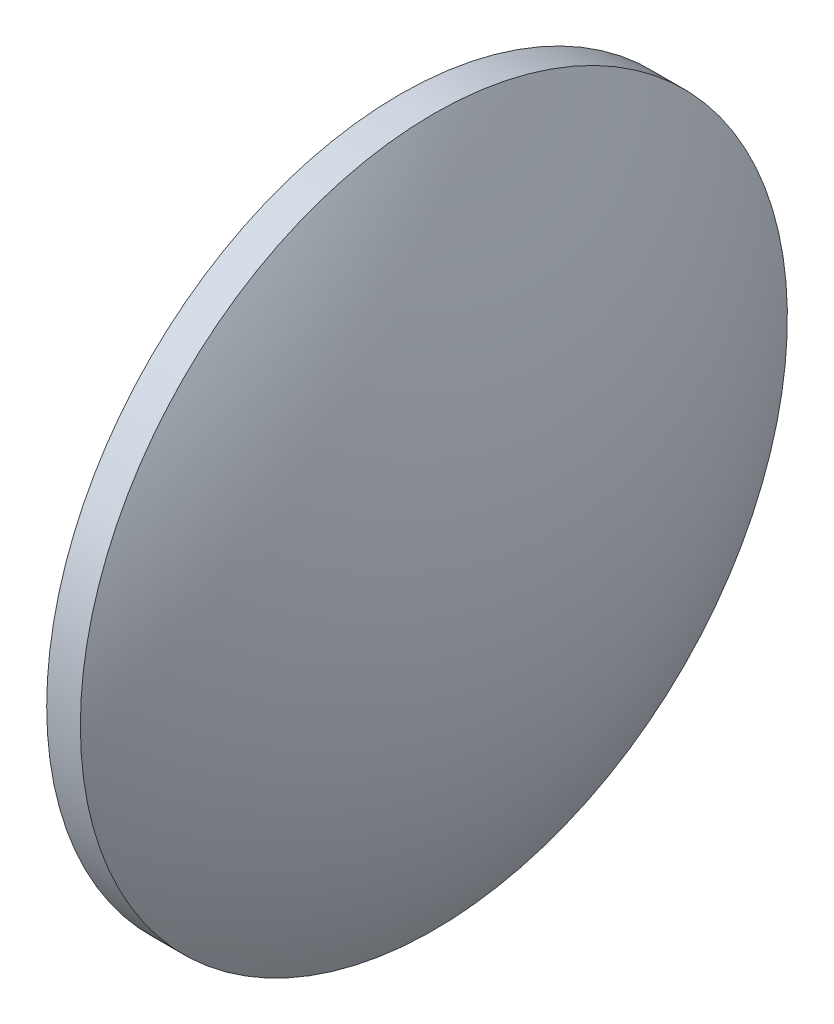
ISO-10303-21;
HEADER;
FILE_DESCRIPTION(('STEP AP214'),'2;1');
FILE_NAME('part.step','',(''),(''),'','','');
FILE_SCHEMA(('AUTOMOTIVE_DESIGN { 1 0 10303 214 1 1 1 1 }'));
ENDSEC;
DATA;
#1=APPLICATION_CONTEXT('core data for automotive mechanical design processes');
#2=APPLICATION_PROTOCOL_DEFINITION('international standard','automotive_design',2000,#1);
#3=PRODUCT_CONTEXT('',#1,'mechanical');
#4=PRODUCT('Part','Part','',(#3));
#5=PRODUCT_RELATED_PRODUCT_CATEGORY('part','',(#4));
#6=PRODUCT_DEFINITION_FORMATION('','',#4);
#7=PRODUCT_DEFINITION_CONTEXT('part definition',#1,'design');
#8=PRODUCT_DEFINITION('design','',#6,#7);
#9=PRODUCT_DEFINITION_SHAPE('','',#8);
#10=(LENGTH_UNIT() NAMED_UNIT(*) SI_UNIT(.MILLI.,.METRE.));
#11=(NAMED_UNIT(*) PLANE_ANGLE_UNIT() SI_UNIT($,.RADIAN.));
#12=(NAMED_UNIT(*) SI_UNIT($,.STERADIAN.) SOLID_ANGLE_UNIT());
#13=UNCERTAINTY_MEASURE_WITH_UNIT(LENGTH_MEASURE(1.E-05),#10,'distance_accuracy_value','');
#14=(GEOMETRIC_REPRESENTATION_CONTEXT(3) GLOBAL_UNCERTAINTY_ASSIGNED_CONTEXT((#13)) GLOBAL_UNIT_ASSIGNED_CONTEXT((#10,
#11,#12)) REPRESENTATION_CONTEXT('',''));
#15=CARTESIAN_POINT('',(0.,0.,0.));
#16=DIRECTION('',(0.,0.,1.));
#17=DIRECTION('',(1.,0.,0.));
#18=AXIS2_PLACEMENT_3D('',#15,#16,#17);
#19=CARTESIAN_POINT('',(265.627636305136,120.583754794098,0.));
#20=DIRECTION('',(-1.,0.,0.));
#21=DIRECTION('',(0.,1.,0.));
#22=AXIS2_PLACEMENT_3D('',#19,#20,#21);
#23=SPHERICAL_SURFACE('',#22,61.3822478352481);
#24=CARTESIAN_POINT('',(212.944409265971,120.583754794099,0.));
#25=DIRECTION('',(-1.,0.,0.));
#26=DIRECTION('',(0.,0.,1.));
#27=AXIS2_PLACEMENT_3D('',#24,#25,#26);
#28=CIRCLE('',#27,31.5001260005037);
#29=CARTESIAN_POINT('',(212.944409265971,120.583754794099,31.5001260005037));
#30=VERTEX_POINT('',#29);
#31=EDGE_CURVE('E41',#30,#30,#28,.T.);
#32=ORIENTED_EDGE('',*,*,#31,.T.);
#33=EDGE_LOOP('',(#32));
#34=FACE_BOUND('',#33,.T.);
#35=ADVANCED_FACE('F35',(#34),#23,.T.);
#36=CARTESIAN_POINT('',(163.261182226807,120.583754794098,0.));
#37=DIRECTION('',(-1.,0.,0.));
#38=DIRECTION('',(0.,1.,0.));
#39=AXIS2_PLACEMENT_3D('',#36,#37,#38);
#40=SPHERICAL_SURFACE('',#39,61.3822478352479);
#41=CARTESIAN_POINT('',(215.944409265971,120.583754794099,0.));
#42=DIRECTION('',(-1.,0.,0.));
#43=DIRECTION('',(0.,0.,1.));
#44=AXIS2_PLACEMENT_3D('',#41,#42,#43);
#45=CIRCLE('',#44,31.5001260005037);
#46=CARTESIAN_POINT('',(215.944409265971,120.583754794099,31.5001260005037));
#47=VERTEX_POINT('',#46);
#48=EDGE_CURVE('E10',#47,#47,#45,.T.);
#49=ORIENTED_EDGE('',*,*,#48,.F.);
#50=EDGE_LOOP('',(#49));
#51=FACE_BOUND('',#50,.T.);
#52=ADVANCED_FACE('F50',(#51),#40,.T.);
#53=CARTESIAN_POINT('',(199.006399593113,120.583754794099,0.));
#54=DIRECTION('',(-1.,0.,0.));
#55=DIRECTION('',(0.,0.,1.));
#56=AXIS2_PLACEMENT_3D('',#53,#54,#55);
#57=CYLINDRICAL_SURFACE('',#56,31.5001260005037);
#58=ORIENTED_EDGE('',*,*,#48,.T.);
#59=EDGE_LOOP('',(#58));
#60=FACE_BOUND('',#59,.T.);
#61=ORIENTED_EDGE('',*,*,#31,.F.);
#62=EDGE_LOOP('',(#61));
#63=FACE_BOUND('',#62,.T.);
#64=ADVANCED_FACE('F48',(#60,#63),#57,.T.);
#65=CLOSED_SHELL('',(#35,#52,#64));
#66=MANIFOLD_SOLID_BREP('B2',#65);
#67=ADVANCED_BREP_SHAPE_REPRESENTATION('',(#18,#66),#14);
#68=SHAPE_DEFINITION_REPRESENTATION(#9,#67);
ENDSEC;
END-ISO-10303-21;
